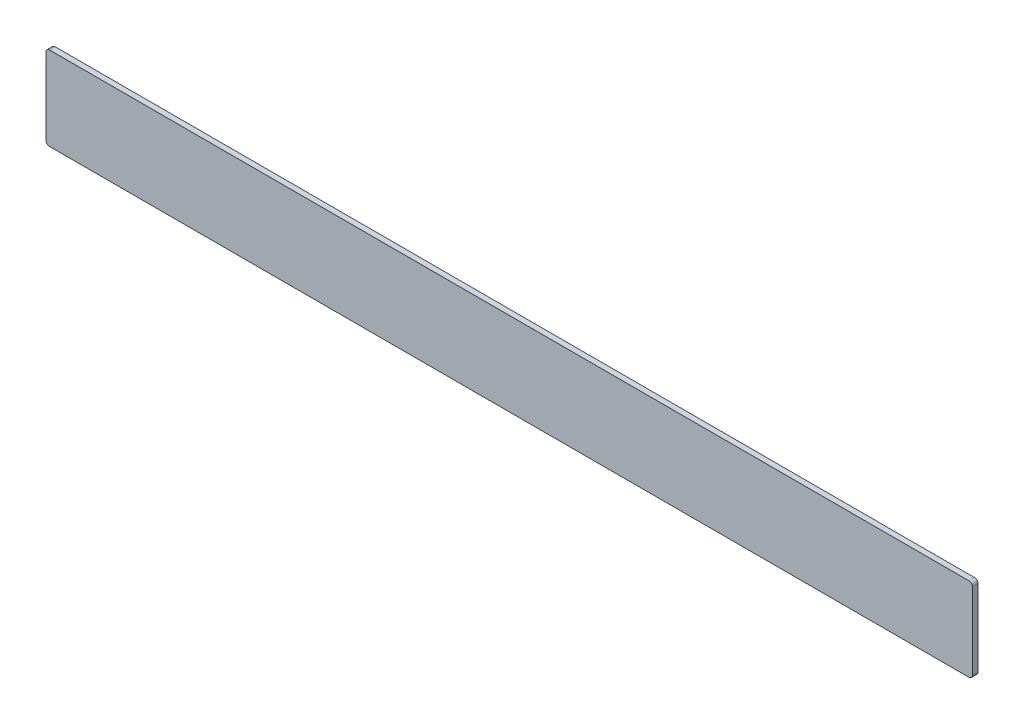
ISO-10303-21;
HEADER;
FILE_DESCRIPTION(('STEP AP214'),'2;1');
FILE_NAME('part.step','',(''),(''),'','','');
FILE_SCHEMA(('AUTOMOTIVE_DESIGN { 1 0 10303 214 1 1 1 1 }'));
ENDSEC;
DATA;
#1=APPLICATION_CONTEXT('core data for automotive mechanical design processes');
#2=APPLICATION_PROTOCOL_DEFINITION('international standard','automotive_design',2000,#1);
#3=PRODUCT_CONTEXT('',#1,'mechanical');
#4=PRODUCT('Part','Part','',(#3));
#5=PRODUCT_RELATED_PRODUCT_CATEGORY('part','',(#4));
#6=PRODUCT_DEFINITION_FORMATION('','',#4);
#7=PRODUCT_DEFINITION_CONTEXT('part definition',#1,'design');
#8=PRODUCT_DEFINITION('design','',#6,#7);
#9=PRODUCT_DEFINITION_SHAPE('','',#8);
#10=(LENGTH_UNIT() NAMED_UNIT(*) SI_UNIT(.MILLI.,.METRE.));
#11=(NAMED_UNIT(*) PLANE_ANGLE_UNIT() SI_UNIT($,.RADIAN.));
#12=(NAMED_UNIT(*) SI_UNIT($,.STERADIAN.) SOLID_ANGLE_UNIT());
#13=UNCERTAINTY_MEASURE_WITH_UNIT(LENGTH_MEASURE(1.E-05),#10,'distance_accuracy_value','');
#14=(GEOMETRIC_REPRESENTATION_CONTEXT(3) GLOBAL_UNCERTAINTY_ASSIGNED_CONTEXT((#13)) GLOBAL_UNIT_ASSIGNED_CONTEXT((#10,
#11,#12)) REPRESENTATION_CONTEXT('',''));
#15=CARTESIAN_POINT('',(0.,0.,0.));
#16=DIRECTION('',(0.,0.,1.));
#17=DIRECTION('',(1.,0.,0.));
#18=AXIS2_PLACEMENT_3D('',#15,#16,#17);
#19=CARTESIAN_POINT('',(665.,-60.,4.));
#20=DIRECTION('',(-1.,0.,0.));
#21=DIRECTION('',(0.,0.,1.));
#22=AXIS2_PLACEMENT_3D('',#19,#20,#21);
#23=PLANE('',#22);
#24=DIRECTION('',(0.,1.,0.));
#25=VECTOR('',#24,1.);
#26=CARTESIAN_POINT('',(665.,-60.,4.));
#27=LINE('',#26,#25);
#28=CARTESIAN_POINT('',(665.,-55.,4.));
#29=VERTEX_POINT('',#28);
#30=CARTESIAN_POINT('',(665.,55.,4.));
#31=VERTEX_POINT('',#30);
#32=EDGE_CURVE('E119',#29,#31,#27,.T.);
#33=ORIENTED_EDGE('',*,*,#32,.F.);
#34=DIRECTION('',(0.,0.,-1.));
#35=VECTOR('',#34,1.);
#36=CARTESIAN_POINT('',(665.,-55.,4.));
#37=LINE('',#36,#35);
#38=CARTESIAN_POINT('',(665.,-55.,-4.));
#39=VERTEX_POINT('',#38);
#40=EDGE_CURVE('E104',#29,#39,#37,.T.);
#41=ORIENTED_EDGE('',*,*,#40,.T.);
#42=DIRECTION('',(0.,1.,0.));
#43=VECTOR('',#42,1.);
#44=CARTESIAN_POINT('',(665.,-60.,-4.));
#45=LINE('',#44,#43);
#46=CARTESIAN_POINT('',(665.,55.,-4.));
#47=VERTEX_POINT('',#46);
#48=EDGE_CURVE('E116',#39,#47,#45,.T.);
#49=ORIENTED_EDGE('',*,*,#48,.T.);
#50=DIRECTION('',(0.,0.,-1.));
#51=VECTOR('',#50,1.);
#52=CARTESIAN_POINT('',(665.,55.,4.));
#53=LINE('',#52,#51);
#54=EDGE_CURVE('E121',#47,#31,#53,.F.);
#55=ORIENTED_EDGE('',*,*,#54,.T.);
#56=EDGE_LOOP('',(#33,#41,#49,#55));
#57=FACE_BOUND('',#56,.T.);
#58=ADVANCED_FACE('F35',(#57),#23,.F.);
#59=CARTESIAN_POINT('',(-665.,60.,4.));
#60=DIRECTION('',(0.,-1.,0.));
#61=DIRECTION('',(0.,0.,-1.));
#62=AXIS2_PLACEMENT_3D('',#59,#60,#61);
#63=PLANE('',#62);
#64=DIRECTION('',(-1.,0.,0.));
#65=VECTOR('',#64,1.);
#66=CARTESIAN_POINT('',(-665.,60.,4.));
#67=LINE('',#66,#65);
#68=CARTESIAN_POINT('',(660.,60.,4.));
#69=VERTEX_POINT('',#68);
#70=CARTESIAN_POINT('',(-660.,60.,4.));
#71=VERTEX_POINT('',#70);
#72=EDGE_CURVE('E170',#69,#71,#67,.T.);
#73=ORIENTED_EDGE('',*,*,#72,.F.);
#74=DIRECTION('',(0.,0.,-1.));
#75=VECTOR('',#74,1.);
#76=CARTESIAN_POINT('',(660.,60.,4.));
#77=LINE('',#76,#75);
#78=CARTESIAN_POINT('',(660.,60.,-4.));
#79=VERTEX_POINT('',#78);
#80=EDGE_CURVE('E154',#69,#79,#77,.T.);
#81=ORIENTED_EDGE('',*,*,#80,.T.);
#82=DIRECTION('',(-1.,0.,0.));
#83=VECTOR('',#82,1.);
#84=CARTESIAN_POINT('',(-665.,60.,-4.));
#85=LINE('',#84,#83);
#86=CARTESIAN_POINT('',(-660.,60.,-4.));
#87=VERTEX_POINT('',#86);
#88=EDGE_CURVE('E125',#79,#87,#85,.T.);
#89=ORIENTED_EDGE('',*,*,#88,.T.);
#90=DIRECTION('',(0.,0.,-1.));
#91=VECTOR('',#90,1.);
#92=CARTESIAN_POINT('',(-660.,60.,4.));
#93=LINE('',#92,#91);
#94=EDGE_CURVE('E152',#87,#71,#93,.F.);
#95=ORIENTED_EDGE('',*,*,#94,.T.);
#96=EDGE_LOOP('',(#73,#81,#89,#95));
#97=FACE_BOUND('',#96,.T.);
#98=ADVANCED_FACE('F180',(#97),#63,.F.);
#99=CARTESIAN_POINT('',(-665.,-60.,4.));
#100=DIRECTION('',(1.,0.,0.));
#101=DIRECTION('',(0.,0.,-1.));
#102=AXIS2_PLACEMENT_3D('',#99,#100,#101);
#103=PLANE('',#102);
#104=DIRECTION('',(0.,-1.,0.));
#105=VECTOR('',#104,1.);
#106=CARTESIAN_POINT('',(-665.,-60.,-4.));
#107=LINE('',#106,#105);
#108=CARTESIAN_POINT('',(-665.,55.,-4.));
#109=VERTEX_POINT('',#108);
#110=CARTESIAN_POINT('',(-665.,-55.,-4.));
#111=VERTEX_POINT('',#110);
#112=EDGE_CURVE('E128',#109,#111,#107,.T.);
#113=ORIENTED_EDGE('',*,*,#112,.T.);
#114=DIRECTION('',(0.,0.,-1.));
#115=VECTOR('',#114,1.);
#116=CARTESIAN_POINT('',(-665.,-55.,4.));
#117=LINE('',#116,#115);
#118=CARTESIAN_POINT('',(-665.,-55.,4.));
#119=VERTEX_POINT('',#118);
#120=EDGE_CURVE('E11',#111,#119,#117,.F.);
#121=ORIENTED_EDGE('',*,*,#120,.T.);
#122=DIRECTION('',(0.,-1.,0.));
#123=VECTOR('',#122,1.);
#124=CARTESIAN_POINT('',(-665.,-60.,4.));
#125=LINE('',#124,#123);
#126=CARTESIAN_POINT('',(-665.,55.,4.));
#127=VERTEX_POINT('',#126);
#128=EDGE_CURVE('E160',#127,#119,#125,.T.);
#129=ORIENTED_EDGE('',*,*,#128,.F.);
#130=DIRECTION('',(0.,0.,-1.));
#131=VECTOR('',#130,1.);
#132=CARTESIAN_POINT('',(-665.,55.,4.));
#133=LINE('',#132,#131);
#134=EDGE_CURVE('E43',#127,#109,#133,.T.);
#135=ORIENTED_EDGE('',*,*,#134,.T.);
#136=EDGE_LOOP('',(#113,#121,#129,#135));
#137=FACE_BOUND('',#136,.T.);
#138=ADVANCED_FACE('F159',(#137),#103,.F.);
#139=CARTESIAN_POINT('',(-665.,-60.,4.));
#140=DIRECTION('',(0.,1.,0.));
#141=DIRECTION('',(0.,0.,1.));
#142=AXIS2_PLACEMENT_3D('',#139,#140,#141);
#143=PLANE('',#142);
#144=DIRECTION('',(1.,0.,0.));
#145=VECTOR('',#144,1.);
#146=CARTESIAN_POINT('',(-665.,-60.,-4.));
#147=LINE('',#146,#145);
#148=CARTESIAN_POINT('',(-660.,-60.,-4.));
#149=VERTEX_POINT('',#148);
#150=CARTESIAN_POINT('',(660.,-60.,-4.));
#151=VERTEX_POINT('',#150);
#152=EDGE_CURVE('E135',#149,#151,#147,.T.);
#153=ORIENTED_EDGE('',*,*,#152,.T.);
#154=DIRECTION('',(0.,0.,-1.));
#155=VECTOR('',#154,1.);
#156=CARTESIAN_POINT('',(660.,-60.,4.));
#157=LINE('',#156,#155);
#158=CARTESIAN_POINT('',(660.,-60.,4.));
#159=VERTEX_POINT('',#158);
#160=EDGE_CURVE('E105',#151,#159,#157,.F.);
#161=ORIENTED_EDGE('',*,*,#160,.T.);
#162=DIRECTION('',(1.,0.,0.));
#163=VECTOR('',#162,1.);
#164=CARTESIAN_POINT('',(-665.,-60.,4.));
#165=LINE('',#164,#163);
#166=CARTESIAN_POINT('',(-660.,-60.,4.));
#167=VERTEX_POINT('',#166);
#168=EDGE_CURVE('E131',#167,#159,#165,.T.);
#169=ORIENTED_EDGE('',*,*,#168,.F.);
#170=DIRECTION('',(0.,0.,-1.));
#171=VECTOR('',#170,1.);
#172=CARTESIAN_POINT('',(-660.,-60.,4.));
#173=LINE('',#172,#171);
#174=EDGE_CURVE('E110',#167,#149,#173,.T.);
#175=ORIENTED_EDGE('',*,*,#174,.T.);
#176=EDGE_LOOP('',(#153,#161,#169,#175));
#177=FACE_BOUND('',#176,.T.);
#178=ADVANCED_FACE('F168',(#177),#143,.F.);
#179=CARTESIAN_POINT('',(0.,0.,4.));
#180=DIRECTION('',(0.,0.,-1.));
#181=DIRECTION('',(-1.,0.,0.));
#182=AXIS2_PLACEMENT_3D('',#179,#180,#181);
#183=PLANE('',#182);
#184=ORIENTED_EDGE('',*,*,#168,.T.);
#185=CARTESIAN_POINT('',(660.,-55.,4.));
#186=DIRECTION('',(0.,0.,-1.));
#187=DIRECTION('',(-1.,0.,0.));
#188=AXIS2_PLACEMENT_3D('',#185,#186,#187);
#189=CIRCLE('',#188,5.);
#190=EDGE_CURVE('E150',#159,#29,#189,.F.);
#191=ORIENTED_EDGE('',*,*,#190,.T.);
#192=ORIENTED_EDGE('',*,*,#32,.T.);
#193=CARTESIAN_POINT('',(660.,55.,4.));
#194=DIRECTION('',(0.,0.,-1.));
#195=DIRECTION('',(-1.,0.,0.));
#196=AXIS2_PLACEMENT_3D('',#193,#194,#195);
#197=CIRCLE('',#196,5.);
#198=EDGE_CURVE('E148',#31,#69,#197,.F.);
#199=ORIENTED_EDGE('',*,*,#198,.T.);
#200=ORIENTED_EDGE('',*,*,#72,.T.);
#201=CARTESIAN_POINT('',(-660.,55.,4.));
#202=DIRECTION('',(0.,0.,-1.));
#203=DIRECTION('',(-1.,0.,0.));
#204=AXIS2_PLACEMENT_3D('',#201,#202,#203);
#205=CIRCLE('',#204,5.);
#206=EDGE_CURVE('E55',#71,#127,#205,.F.);
#207=ORIENTED_EDGE('',*,*,#206,.T.);
#208=ORIENTED_EDGE('',*,*,#128,.T.);
#209=CARTESIAN_POINT('',(-660.,-55.,4.));
#210=DIRECTION('',(0.,0.,-1.));
#211=DIRECTION('',(-1.,0.,0.));
#212=AXIS2_PLACEMENT_3D('',#209,#210,#211);
#213=CIRCLE('',#212,5.);
#214=EDGE_CURVE('E146',#119,#167,#213,.F.);
#215=ORIENTED_EDGE('',*,*,#214,.T.);
#216=EDGE_LOOP('',(#184,#191,#192,#199,#200,#207,#208,#215));
#217=FACE_BOUND('',#216,.T.);
#218=ADVANCED_FACE('F174',(#217),#183,.F.);
#219=CARTESIAN_POINT('',(0.,0.,-4.));
#220=DIRECTION('',(0.,0.,-1.));
#221=DIRECTION('',(-1.,0.,0.));
#222=AXIS2_PLACEMENT_3D('',#219,#220,#221);
#223=PLANE('',#222);
#224=ORIENTED_EDGE('',*,*,#48,.F.);
#225=CARTESIAN_POINT('',(660.,-55.,-4.));
#226=DIRECTION('',(0.,0.,-1.));
#227=DIRECTION('',(-1.,0.,0.));
#228=AXIS2_PLACEMENT_3D('',#225,#226,#227);
#229=CIRCLE('',#228,5.);
#230=EDGE_CURVE('E100',#39,#151,#229,.T.);
#231=ORIENTED_EDGE('',*,*,#230,.T.);
#232=ORIENTED_EDGE('',*,*,#152,.F.);
#233=CARTESIAN_POINT('',(-660.,-55.,-4.));
#234=DIRECTION('',(0.,0.,-1.));
#235=DIRECTION('',(-1.,0.,0.));
#236=AXIS2_PLACEMENT_3D('',#233,#234,#235);
#237=CIRCLE('',#236,5.);
#238=EDGE_CURVE('E139',#149,#111,#237,.T.);
#239=ORIENTED_EDGE('',*,*,#238,.T.);
#240=ORIENTED_EDGE('',*,*,#112,.F.);
#241=CARTESIAN_POINT('',(-660.,55.,-4.));
#242=DIRECTION('',(0.,0.,-1.));
#243=DIRECTION('',(-1.,0.,0.));
#244=AXIS2_PLACEMENT_3D('',#241,#242,#243);
#245=CIRCLE('',#244,5.);
#246=EDGE_CURVE('E120',#109,#87,#245,.T.);
#247=ORIENTED_EDGE('',*,*,#246,.T.);
#248=ORIENTED_EDGE('',*,*,#88,.F.);
#249=CARTESIAN_POINT('',(660.,55.,-4.));
#250=DIRECTION('',(0.,0.,-1.));
#251=DIRECTION('',(-1.,0.,0.));
#252=AXIS2_PLACEMENT_3D('',#249,#250,#251);
#253=CIRCLE('',#252,5.);
#254=EDGE_CURVE('E111',#79,#47,#253,.T.);
#255=ORIENTED_EDGE('',*,*,#254,.T.);
#256=EDGE_LOOP('',(#224,#231,#232,#239,#240,#247,#248,#255));
#257=FACE_BOUND('',#256,.T.);
#258=ADVANCED_FACE('F123',(#257),#223,.T.);
#259=CARTESIAN_POINT('',(660.,-55.,4.));
#260=DIRECTION('',(0.,0.,-1.));
#261=DIRECTION('',(-1.,0.,0.));
#262=AXIS2_PLACEMENT_3D('',#259,#260,#261);
#263=CYLINDRICAL_SURFACE('',#262,5.);
#264=ORIENTED_EDGE('',*,*,#190,.F.);
#265=ORIENTED_EDGE('',*,*,#160,.F.);
#266=ORIENTED_EDGE('',*,*,#230,.F.);
#267=ORIENTED_EDGE('',*,*,#40,.F.);
#268=EDGE_LOOP('',(#264,#265,#266,#267));
#269=FACE_BOUND('',#268,.T.);
#270=ADVANCED_FACE('F103',(#269),#263,.T.);
#271=CARTESIAN_POINT('',(660.,55.,4.));
#272=DIRECTION('',(0.,0.,-1.));
#273=DIRECTION('',(-1.,0.,0.));
#274=AXIS2_PLACEMENT_3D('',#271,#272,#273);
#275=CYLINDRICAL_SURFACE('',#274,5.);
#276=ORIENTED_EDGE('',*,*,#198,.F.);
#277=ORIENTED_EDGE('',*,*,#54,.F.);
#278=ORIENTED_EDGE('',*,*,#254,.F.);
#279=ORIENTED_EDGE('',*,*,#80,.F.);
#280=EDGE_LOOP('',(#276,#277,#278,#279));
#281=FACE_BOUND('',#280,.T.);
#282=ADVANCED_FACE('F178',(#281),#275,.T.);
#283=CARTESIAN_POINT('',(-660.,-55.,4.));
#284=DIRECTION('',(0.,0.,-1.));
#285=DIRECTION('',(-1.,0.,0.));
#286=AXIS2_PLACEMENT_3D('',#283,#284,#285);
#287=CYLINDRICAL_SURFACE('',#286,5.);
#288=ORIENTED_EDGE('',*,*,#214,.F.);
#289=ORIENTED_EDGE('',*,*,#120,.F.);
#290=ORIENTED_EDGE('',*,*,#238,.F.);
#291=ORIENTED_EDGE('',*,*,#174,.F.);
#292=EDGE_LOOP('',(#288,#289,#290,#291));
#293=FACE_BOUND('',#292,.T.);
#294=ADVANCED_FACE('F165',(#293),#287,.T.);
#295=CARTESIAN_POINT('',(-660.,55.,4.));
#296=DIRECTION('',(0.,0.,-1.));
#297=DIRECTION('',(-1.,0.,0.));
#298=AXIS2_PLACEMENT_3D('',#295,#296,#297);
#299=CYLINDRICAL_SURFACE('',#298,5.);
#300=ORIENTED_EDGE('',*,*,#206,.F.);
#301=ORIENTED_EDGE('',*,*,#94,.F.);
#302=ORIENTED_EDGE('',*,*,#246,.F.);
#303=ORIENTED_EDGE('',*,*,#134,.F.);
#304=EDGE_LOOP('',(#300,#301,#302,#303));
#305=FACE_BOUND('',#304,.T.);
#306=ADVANCED_FACE('F37',(#305),#299,.T.);
#307=CLOSED_SHELL('',(#58,#98,#138,#178,#218,#258,#270,#282,#294,#306));
#308=MANIFOLD_SOLID_BREP('B2',#307);
#309=ADVANCED_BREP_SHAPE_REPRESENTATION('',(#18,#308),#14);
#310=SHAPE_DEFINITION_REPRESENTATION(#9,#309);
ENDSEC;
END-ISO-10303-21;
